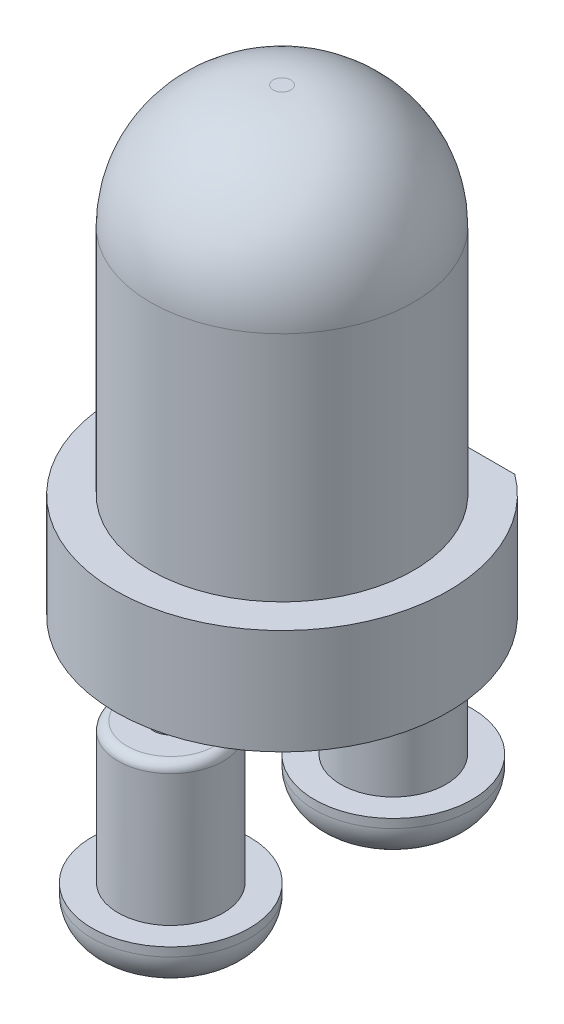
ISO-10303-21;
HEADER;
FILE_DESCRIPTION(('STEP AP214'),'2;1');
FILE_NAME('part.step','',(''),(''),'','','');
FILE_SCHEMA(('AUTOMOTIVE_DESIGN { 1 0 10303 214 1 1 1 1 }'));
ENDSEC;
DATA;
#1=APPLICATION_CONTEXT('core data for automotive mechanical design processes');
#2=APPLICATION_PROTOCOL_DEFINITION('international standard','automotive_design',2000,#1);
#3=PRODUCT_CONTEXT('',#1,'mechanical');
#4=PRODUCT('Part','Part','',(#3));
#5=PRODUCT_RELATED_PRODUCT_CATEGORY('part','',(#4));
#6=PRODUCT_DEFINITION_FORMATION('','',#4);
#7=PRODUCT_DEFINITION_CONTEXT('part definition',#1,'design');
#8=PRODUCT_DEFINITION('design','',#6,#7);
#9=PRODUCT_DEFINITION_SHAPE('','',#8);
#10=(LENGTH_UNIT() NAMED_UNIT(*) SI_UNIT(.MILLI.,.METRE.));
#11=(NAMED_UNIT(*) PLANE_ANGLE_UNIT() SI_UNIT($,.RADIAN.));
#12=(NAMED_UNIT(*) SI_UNIT($,.STERADIAN.) SOLID_ANGLE_UNIT());
#13=UNCERTAINTY_MEASURE_WITH_UNIT(LENGTH_MEASURE(1.E-05),#10,'distance_accuracy_value','');
#14=(GEOMETRIC_REPRESENTATION_CONTEXT(3) GLOBAL_UNCERTAINTY_ASSIGNED_CONTEXT((#13)) GLOBAL_UNIT_ASSIGNED_CONTEXT((#10,
#11,#12)) REPRESENTATION_CONTEXT('',''));
#15=CARTESIAN_POINT('',(0.,0.,0.));
#16=DIRECTION('',(0.,0.,1.));
#17=DIRECTION('',(1.,0.,0.));
#18=AXIS2_PLACEMENT_3D('',#15,#16,#17);
#19=CARTESIAN_POINT('',(0.,0.,0.));
#20=DIRECTION('',(0.,-1.,0.));
#21=DIRECTION('',(0.,0.,-1.));
#22=AXIS2_PLACEMENT_3D('',#19,#20,#21);
#23=PLANE('',#22);
#24=CARTESIAN_POINT('',(0.,0.,-1.27));
#25=DIRECTION('',(0.,-1.,0.));
#26=DIRECTION('',(0.,0.,-1.));
#27=AXIS2_PLACEMENT_3D('',#24,#25,#26);
#28=CIRCLE('',#27,0.2);
#29=CARTESIAN_POINT('',(0.,0.,-1.47));
#30=VERTEX_POINT('',#29);
#31=EDGE_CURVE('E175',#30,#30,#28,.T.);
#32=ORIENTED_EDGE('',*,*,#31,.F.);
#33=EDGE_LOOP('',(#32));
#34=FACE_BOUND('',#33,.T.);
#35=CARTESIAN_POINT('',(0.,0.,1.27));
#36=DIRECTION('',(0.,-1.,0.));
#37=DIRECTION('',(0.,0.,-1.));
#38=AXIS2_PLACEMENT_3D('',#35,#36,#37);
#39=CIRCLE('',#38,0.2);
#40=CARTESIAN_POINT('',(0.,0.,1.07));
#41=VERTEX_POINT('',#40);
#42=EDGE_CURVE('E178',#41,#41,#39,.T.);
#43=ORIENTED_EDGE('',*,*,#42,.F.);
#44=EDGE_LOOP('',(#43));
#45=FACE_BOUND('',#44,.T.);
#46=DIRECTION('',(1.,0.,0.));
#47=VECTOR('',#46,1.);
#48=CARTESIAN_POINT('',(-1.5,0.,-1.53));
#49=LINE('',#48,#47);
#50=CARTESIAN_POINT('',(-1.12654338576018,0.,-1.53));
#51=VERTEX_POINT('',#50);
#52=CARTESIAN_POINT('',(1.12654338576017,0.,-1.53));
#53=VERTEX_POINT('',#52);
#54=EDGE_CURVE('E60',#51,#53,#49,.T.);
#55=ORIENTED_EDGE('',*,*,#54,.T.);
#56=CARTESIAN_POINT('',(0.,0.,0.));
#57=DIRECTION('',(0.,-1.,0.));
#58=DIRECTION('',(0.,0.,-1.));
#59=AXIS2_PLACEMENT_3D('',#56,#57,#58);
#60=CIRCLE('',#59,1.9);
#61=EDGE_CURVE('E66',#53,#51,#60,.T.);
#62=ORIENTED_EDGE('',*,*,#61,.T.);
#63=EDGE_LOOP('',(#55,#62));
#64=FACE_BOUND('',#63,.T.);
#65=ADVANCED_FACE('F35',(#34,#45,#64),#23,.T.);
#66=CARTESIAN_POINT('',(0.1,5.25,0.));
#67=DIRECTION('',(0.,1.,0.));
#68=DIRECTION('',(0.,0.,1.));
#69=AXIS2_PLACEMENT_3D('',#66,#67,#68);
#70=PLANE('',#69);
#71=CARTESIAN_POINT('',(0.,5.25,0.));
#72=DIRECTION('',(0.,-1.,0.));
#73=DIRECTION('',(0.,0.,-1.));
#74=AXIS2_PLACEMENT_3D('',#71,#72,#73);
#75=CIRCLE('',#74,0.1);
#76=CARTESIAN_POINT('',(0.,5.25,-0.1));
#77=VERTEX_POINT('',#76);
#78=EDGE_CURVE('E85',#77,#77,#75,.T.);
#79=ORIENTED_EDGE('',*,*,#78,.F.);
#80=EDGE_LOOP('',(#79));
#81=FACE_BOUND('',#80,.T.);
#82=ADVANCED_FACE('F134',(#81),#70,.T.);
#83=CARTESIAN_POINT('',(0.,3.85,0.));
#84=DIRECTION('',(0.,-1.,0.));
#85=DIRECTION('',(0.,0.,-1.));
#86=AXIS2_PLACEMENT_3D('',#83,#84,#85);
#87=DEGENERATE_TOROIDAL_SURFACE('',#86,0.1,1.4,.T.);
#88=ORIENTED_EDGE('',*,*,#78,.T.);
#89=EDGE_LOOP('',(#88));
#90=FACE_BOUND('',#89,.T.);
#91=CARTESIAN_POINT('',(0.,3.85,0.));
#92=DIRECTION('',(0.,-1.,0.));
#93=DIRECTION('',(0.,0.,-1.));
#94=AXIS2_PLACEMENT_3D('',#91,#92,#93);
#95=CIRCLE('',#94,1.5);
#96=CARTESIAN_POINT('',(0.,3.85,-1.5));
#97=VERTEX_POINT('',#96);
#98=EDGE_CURVE('E82',#97,#97,#95,.T.);
#99=ORIENTED_EDGE('',*,*,#98,.F.);
#100=EDGE_LOOP('',(#99));
#101=FACE_BOUND('',#100,.T.);
#102=ADVANCED_FACE('F140',(#90,#101),#87,.T.);
#103=CARTESIAN_POINT('',(0.,0.,0.));
#104=DIRECTION('',(0.,-1.,0.));
#105=DIRECTION('',(0.,0.,-1.));
#106=AXIS2_PLACEMENT_3D('',#103,#104,#105);
#107=CYLINDRICAL_SURFACE('',#106,1.5);
#108=ORIENTED_EDGE('',*,*,#98,.T.);
#109=EDGE_LOOP('',(#108));
#110=FACE_BOUND('',#109,.T.);
#111=CARTESIAN_POINT('',(0.,1.2,0.));
#112=DIRECTION('',(0.,-1.,0.));
#113=DIRECTION('',(0.,0.,-1.));
#114=AXIS2_PLACEMENT_3D('',#111,#112,#113);
#115=CIRCLE('',#114,1.5);
#116=CARTESIAN_POINT('',(0.,1.2,-1.5));
#117=VERTEX_POINT('',#116);
#118=EDGE_CURVE('E76',#117,#117,#115,.T.);
#119=ORIENTED_EDGE('',*,*,#118,.F.);
#120=EDGE_LOOP('',(#119));
#121=FACE_BOUND('',#120,.T.);
#122=ADVANCED_FACE('F205',(#110,#121),#107,.T.);
#123=CARTESIAN_POINT('',(1.9,1.2,0.));
#124=DIRECTION('',(0.,1.,0.));
#125=DIRECTION('',(0.,0.,1.));
#126=AXIS2_PLACEMENT_3D('',#123,#124,#125);
#127=PLANE('',#126);
#128=DIRECTION('',(1.,0.,0.));
#129=VECTOR('',#128,1.);
#130=CARTESIAN_POINT('',(-1.5,1.2,-1.53));
#131=LINE('',#130,#129);
#132=CARTESIAN_POINT('',(-1.12654338576018,1.2,-1.53));
#133=VERTEX_POINT('',#132);
#134=CARTESIAN_POINT('',(1.12654338576018,1.2,-1.53));
#135=VERTEX_POINT('',#134);
#136=EDGE_CURVE('E50',#133,#135,#131,.T.);
#137=ORIENTED_EDGE('',*,*,#136,.F.);
#138=CARTESIAN_POINT('',(0.,1.2,0.));
#139=DIRECTION('',(0.,-1.,0.));
#140=DIRECTION('',(0.,0.,-1.));
#141=AXIS2_PLACEMENT_3D('',#138,#139,#140);
#142=CIRCLE('',#141,1.9);
#143=EDGE_CURVE('E72',#135,#133,#142,.T.);
#144=ORIENTED_EDGE('',*,*,#143,.F.);
#145=EDGE_LOOP('',(#137,#144));
#146=FACE_BOUND('',#145,.T.);
#147=ORIENTED_EDGE('',*,*,#118,.T.);
#148=EDGE_LOOP('',(#147));
#149=FACE_BOUND('',#148,.T.);
#150=ADVANCED_FACE('F202',(#146,#149),#127,.T.);
#151=CARTESIAN_POINT('',(0.,0.,0.));
#152=DIRECTION('',(0.,-1.,0.));
#153=DIRECTION('',(0.,0.,-1.));
#154=AXIS2_PLACEMENT_3D('',#151,#152,#153);
#155=CYLINDRICAL_SURFACE('',#154,1.9);
#156=DIRECTION('',(0.,-1.,0.));
#157=VECTOR('',#156,1.);
#158=CARTESIAN_POINT('',(-1.12654338576018,0.,-1.53));
#159=LINE('',#158,#157);
#160=EDGE_CURVE('E55',#51,#133,#159,.F.);
#161=ORIENTED_EDGE('',*,*,#160,.F.);
#162=ORIENTED_EDGE('',*,*,#61,.F.);
#163=DIRECTION('',(0.,-1.,0.));
#164=VECTOR('',#163,1.);
#165=CARTESIAN_POINT('',(1.12654338576018,0.,-1.53));
#166=LINE('',#165,#164);
#167=EDGE_CURVE('E62',#135,#53,#166,.T.);
#168=ORIENTED_EDGE('',*,*,#167,.F.);
#169=ORIENTED_EDGE('',*,*,#143,.T.);
#170=EDGE_LOOP('',(#161,#162,#168,#169));
#171=FACE_BOUND('',#170,.T.);
#172=ADVANCED_FACE('F70',(#171),#155,.T.);
#173=CARTESIAN_POINT('',(-1.5,-3.04138126514911,-1.53));
#174=DIRECTION('',(0.,0.,1.));
#175=DIRECTION('',(1.,0.,0.));
#176=AXIS2_PLACEMENT_3D('',#173,#174,#175);
#177=PLANE('',#176);
#178=ORIENTED_EDGE('',*,*,#160,.T.);
#179=ORIENTED_EDGE('',*,*,#136,.T.);
#180=ORIENTED_EDGE('',*,*,#167,.T.);
#181=ORIENTED_EDGE('',*,*,#54,.F.);
#182=EDGE_LOOP('',(#178,#179,#180,#181));
#183=FACE_BOUND('',#182,.T.);
#184=ADVANCED_FACE('F61',(#183),#177,.F.);
#185=CARTESIAN_POINT('',(0.,-17.5,1.27));
#186=DIRECTION('',(0.,1.,0.));
#187=DIRECTION('',(0.,0.,1.));
#188=AXIS2_PLACEMENT_3D('',#185,#186,#187);
#189=CYLINDRICAL_SURFACE('',#188,0.2);
#190=CARTESIAN_POINT('',(0.,-0.400000000000001,1.27));
#191=DIRECTION('',(0.,1.,0.));
#192=DIRECTION('',(0.,0.,1.));
#193=AXIS2_PLACEMENT_3D('',#190,#191,#192);
#194=CIRCLE('',#193,0.2);
#195=CARTESIAN_POINT('',(0.,-0.400000000000001,1.47));
#196=VERTEX_POINT('',#195);
#197=EDGE_CURVE('E104',#196,#196,#194,.T.);
#198=ORIENTED_EDGE('',*,*,#197,.T.);
#199=EDGE_LOOP('',(#198));
#200=FACE_BOUND('',#199,.T.);
#201=ORIENTED_EDGE('',*,*,#42,.T.);
#202=EDGE_LOOP('',(#201));
#203=FACE_BOUND('',#202,.T.);
#204=ADVANCED_FACE('F186',(#200,#203),#189,.T.);
#205=CARTESIAN_POINT('',(0.,-17.5,-1.27));
#206=DIRECTION('',(0.,1.,0.));
#207=DIRECTION('',(0.,0.,1.));
#208=AXIS2_PLACEMENT_3D('',#205,#206,#207);
#209=CYLINDRICAL_SURFACE('',#208,0.2);
#210=CARTESIAN_POINT('',(0.,-0.400000000000001,-1.27));
#211=DIRECTION('',(0.,1.,0.));
#212=DIRECTION('',(0.,0.,1.));
#213=AXIS2_PLACEMENT_3D('',#210,#211,#212);
#214=CIRCLE('',#213,0.2);
#215=CARTESIAN_POINT('',(0.,-0.400000000000001,-1.07));
#216=VERTEX_POINT('',#215);
#217=EDGE_CURVE('E108',#216,#216,#214,.T.);
#218=ORIENTED_EDGE('',*,*,#217,.T.);
#219=EDGE_LOOP('',(#218));
#220=FACE_BOUND('',#219,.T.);
#221=ORIENTED_EDGE('',*,*,#31,.T.);
#222=EDGE_LOOP('',(#221));
#223=FACE_BOUND('',#222,.T.);
#224=ADVANCED_FACE('F188',(#220,#223),#209,.T.);
#225=CARTESIAN_POINT('',(0.,-0.4,1.27));
#226=DIRECTION('',(0.,-1.,0.));
#227=DIRECTION('',(0.,0.,-1.));
#228=AXIS2_PLACEMENT_3D('',#225,#226,#227);
#229=CYLINDRICAL_SURFACE('',#228,0.6);
#230=CARTESIAN_POINT('',(0.,-0.5,1.27));
#231=DIRECTION('',(0.,1.,0.));
#232=DIRECTION('',(0.,0.,1.));
#233=AXIS2_PLACEMENT_3D('',#230,#231,#232);
#234=CIRCLE('',#233,0.6);
#235=CARTESIAN_POINT('',(0.,-0.5,1.87));
#236=VERTEX_POINT('',#235);
#237=EDGE_CURVE('E11',#236,#236,#234,.F.);
#238=ORIENTED_EDGE('',*,*,#237,.T.);
#239=EDGE_LOOP('',(#238));
#240=FACE_BOUND('',#239,.T.);
#241=CARTESIAN_POINT('',(0.,-2.,1.27));
#242=DIRECTION('',(0.,-1.,0.));
#243=DIRECTION('',(0.,0.,-1.));
#244=AXIS2_PLACEMENT_3D('',#241,#242,#243);
#245=CIRCLE('',#244,0.6);
#246=CARTESIAN_POINT('',(0.,-2.,0.67));
#247=VERTEX_POINT('',#246);
#248=EDGE_CURVE('E100',#247,#247,#245,.F.);
#249=ORIENTED_EDGE('',*,*,#248,.T.);
#250=EDGE_LOOP('',(#249));
#251=FACE_BOUND('',#250,.T.);
#252=ADVANCED_FACE('F195',(#240,#251),#229,.T.);
#253=CARTESIAN_POINT('',(0.,-0.4,1.27));
#254=DIRECTION('',(0.,1.,0.));
#255=DIRECTION('',(0.,0.,1.));
#256=AXIS2_PLACEMENT_3D('',#253,#254,#255);
#257=PLANE('',#256);
#258=CARTESIAN_POINT('',(0.,-0.4,1.27));
#259=DIRECTION('',(0.,1.,0.));
#260=DIRECTION('',(0.,0.,1.));
#261=AXIS2_PLACEMENT_3D('',#258,#259,#260);
#262=CIRCLE('',#261,0.5);
#263=CARTESIAN_POINT('',(0.,-0.4,1.77));
#264=VERTEX_POINT('',#263);
#265=EDGE_CURVE('E43',#264,#264,#262,.T.);
#266=ORIENTED_EDGE('',*,*,#265,.T.);
#267=EDGE_LOOP('',(#266));
#268=FACE_BOUND('',#267,.T.);
#269=ORIENTED_EDGE('',*,*,#197,.F.);
#270=EDGE_LOOP('',(#269));
#271=FACE_BOUND('',#270,.T.);
#272=ADVANCED_FACE('F121',(#268,#271),#257,.T.);
#273=CARTESIAN_POINT('',(0.,-2.5,1.27));
#274=DIRECTION('',(0.,-1.,0.));
#275=DIRECTION('',(0.,0.,-1.));
#276=AXIS2_PLACEMENT_3D('',#273,#274,#275);
#277=PLANE('',#276);
#278=CARTESIAN_POINT('',(0.,-2.5,1.27));
#279=DIRECTION('',(0.,-1.,0.));
#280=DIRECTION('',(0.,0.,-1.));
#281=AXIS2_PLACEMENT_3D('',#278,#279,#280);
#282=CIRCLE('',#281,0.5);
#283=CARTESIAN_POINT('',(0.,-2.5,0.77));
#284=VERTEX_POINT('',#283);
#285=EDGE_CURVE('E94',#284,#284,#282,.T.);
#286=ORIENTED_EDGE('',*,*,#285,.T.);
#287=EDGE_LOOP('',(#286));
#288=FACE_BOUND('',#287,.T.);
#289=ADVANCED_FACE('F156',(#288),#277,.T.);
#290=CARTESIAN_POINT('',(0.,-2.1,1.27));
#291=DIRECTION('',(0.,-1.,0.));
#292=DIRECTION('',(0.,0.,-1.));
#293=AXIS2_PLACEMENT_3D('',#290,#291,#292);
#294=TOROIDAL_SURFACE('',#293,0.5,0.4);
#295=CARTESIAN_POINT('',(0.,-2.1,1.27));
#296=DIRECTION('',(0.,-1.,0.));
#297=DIRECTION('',(0.,0.,-1.));
#298=AXIS2_PLACEMENT_3D('',#295,#296,#297);
#299=CIRCLE('',#298,0.9);
#300=CARTESIAN_POINT('',(0.,-2.1,0.37));
#301=VERTEX_POINT('',#300);
#302=EDGE_CURVE('E97',#301,#301,#299,.F.);
#303=ORIENTED_EDGE('',*,*,#302,.F.);
#304=EDGE_LOOP('',(#303));
#305=FACE_BOUND('',#304,.T.);
#306=ORIENTED_EDGE('',*,*,#285,.F.);
#307=EDGE_LOOP('',(#306));
#308=FACE_BOUND('',#307,.T.);
#309=ADVANCED_FACE('F153',(#305,#308),#294,.T.);
#310=CARTESIAN_POINT('',(0.,-2.5,1.27));
#311=DIRECTION('',(0.,1.,0.));
#312=DIRECTION('',(0.,0.,1.));
#313=AXIS2_PLACEMENT_3D('',#310,#311,#312);
#314=CYLINDRICAL_SURFACE('',#313,0.9);
#315=ORIENTED_EDGE('',*,*,#302,.T.);
#316=EDGE_LOOP('',(#315));
#317=FACE_BOUND('',#316,.T.);
#318=CARTESIAN_POINT('',(0.,-2.,1.27));
#319=DIRECTION('',(0.,-1.,0.));
#320=DIRECTION('',(0.,0.,-1.));
#321=AXIS2_PLACEMENT_3D('',#318,#319,#320);
#322=CIRCLE('',#321,0.9);
#323=CARTESIAN_POINT('',(0.,-2.,0.37));
#324=VERTEX_POINT('',#323);
#325=EDGE_CURVE('E173',#324,#324,#322,.T.);
#326=ORIENTED_EDGE('',*,*,#325,.T.);
#327=EDGE_LOOP('',(#326));
#328=FACE_BOUND('',#327,.T.);
#329=ADVANCED_FACE('F155',(#317,#328),#314,.T.);
#330=CARTESIAN_POINT('',(0.,-2.,1.27));
#331=DIRECTION('',(0.,-1.,0.));
#332=DIRECTION('',(0.,0.,-1.));
#333=AXIS2_PLACEMENT_3D('',#330,#331,#332);
#334=PLANE('',#333);
#335=ORIENTED_EDGE('',*,*,#248,.F.);
#336=EDGE_LOOP('',(#335));
#337=FACE_BOUND('',#336,.T.);
#338=ORIENTED_EDGE('',*,*,#325,.F.);
#339=EDGE_LOOP('',(#338));
#340=FACE_BOUND('',#339,.T.);
#341=ADVANCED_FACE('F162',(#337,#340),#334,.F.);
#342=CARTESIAN_POINT('',(0.,-0.4,-1.27));
#343=DIRECTION('',(0.,-1.,0.));
#344=DIRECTION('',(0.,0.,-1.));
#345=AXIS2_PLACEMENT_3D('',#342,#343,#344);
#346=CYLINDRICAL_SURFACE('',#345,0.6);
#347=CARTESIAN_POINT('',(0.,-0.5,-1.27));
#348=DIRECTION('',(0.,1.,0.));
#349=DIRECTION('',(0.,0.,1.));
#350=AXIS2_PLACEMENT_3D('',#347,#348,#349);
#351=CIRCLE('',#350,0.6);
#352=CARTESIAN_POINT('',(0.,-0.5,-0.67));
#353=VERTEX_POINT('',#352);
#354=EDGE_CURVE('E116',#353,#353,#351,.F.);
#355=ORIENTED_EDGE('',*,*,#354,.T.);
#356=EDGE_LOOP('',(#355));
#357=FACE_BOUND('',#356,.T.);
#358=CARTESIAN_POINT('',(0.,-2.,-1.27));
#359=DIRECTION('',(0.,-1.,0.));
#360=DIRECTION('',(0.,0.,-1.));
#361=AXIS2_PLACEMENT_3D('',#358,#359,#360);
#362=CIRCLE('',#361,0.6);
#363=CARTESIAN_POINT('',(0.,-2.,-1.87));
#364=VERTEX_POINT('',#363);
#365=EDGE_CURVE('E103',#364,#364,#362,.F.);
#366=ORIENTED_EDGE('',*,*,#365,.T.);
#367=EDGE_LOOP('',(#366));
#368=FACE_BOUND('',#367,.T.);
#369=ADVANCED_FACE('F309',(#357,#368),#346,.T.);
#370=CARTESIAN_POINT('',(0.,-0.4,-1.27));
#371=DIRECTION('',(0.,1.,0.));
#372=DIRECTION('',(0.,0.,1.));
#373=AXIS2_PLACEMENT_3D('',#370,#371,#372);
#374=PLANE('',#373);
#375=CARTESIAN_POINT('',(0.,-0.4,-1.27));
#376=DIRECTION('',(0.,1.,0.));
#377=DIRECTION('',(0.,0.,1.));
#378=AXIS2_PLACEMENT_3D('',#375,#376,#377);
#379=CIRCLE('',#378,0.5);
#380=CARTESIAN_POINT('',(0.,-0.4,-0.77));
#381=VERTEX_POINT('',#380);
#382=EDGE_CURVE('E111',#381,#381,#379,.T.);
#383=ORIENTED_EDGE('',*,*,#382,.T.);
#384=EDGE_LOOP('',(#383));
#385=FACE_BOUND('',#384,.T.);
#386=ORIENTED_EDGE('',*,*,#217,.F.);
#387=EDGE_LOOP('',(#386));
#388=FACE_BOUND('',#387,.T.);
#389=ADVANCED_FACE('F278',(#385,#388),#374,.T.);
#390=CARTESIAN_POINT('',(0.,-2.5,-1.27));
#391=DIRECTION('',(0.,-1.,0.));
#392=DIRECTION('',(0.,0.,-1.));
#393=AXIS2_PLACEMENT_3D('',#390,#391,#392);
#394=PLANE('',#393);
#395=CARTESIAN_POINT('',(0.,-2.5,-1.27));
#396=DIRECTION('',(0.,-1.,0.));
#397=DIRECTION('',(0.,0.,-1.));
#398=AXIS2_PLACEMENT_3D('',#395,#396,#397);
#399=CIRCLE('',#398,0.5);
#400=CARTESIAN_POINT('',(0.,-2.5,-1.77));
#401=VERTEX_POINT('',#400);
#402=EDGE_CURVE('E73',#401,#401,#399,.T.);
#403=ORIENTED_EDGE('',*,*,#402,.T.);
#404=EDGE_LOOP('',(#403));
#405=FACE_BOUND('',#404,.T.);
#406=ADVANCED_FACE('F151',(#405),#394,.T.);
#407=CARTESIAN_POINT('',(0.,-2.1,-1.27));
#408=DIRECTION('',(0.,-1.,0.));
#409=DIRECTION('',(0.,0.,-1.));
#410=AXIS2_PLACEMENT_3D('',#407,#408,#409);
#411=TOROIDAL_SURFACE('',#410,0.5,0.4);
#412=CARTESIAN_POINT('',(0.,-2.1,-1.27));
#413=DIRECTION('',(0.,-1.,0.));
#414=DIRECTION('',(0.,0.,-1.));
#415=AXIS2_PLACEMENT_3D('',#412,#413,#414);
#416=CIRCLE('',#415,0.9);
#417=CARTESIAN_POINT('',(0.,-2.1,-2.17));
#418=VERTEX_POINT('',#417);
#419=EDGE_CURVE('E91',#418,#418,#416,.F.);
#420=ORIENTED_EDGE('',*,*,#419,.F.);
#421=EDGE_LOOP('',(#420));
#422=FACE_BOUND('',#421,.T.);
#423=ORIENTED_EDGE('',*,*,#402,.F.);
#424=EDGE_LOOP('',(#423));
#425=FACE_BOUND('',#424,.T.);
#426=ADVANCED_FACE('F147',(#422,#425),#411,.T.);
#427=CARTESIAN_POINT('',(0.,-2.5,-1.27));
#428=DIRECTION('',(0.,1.,0.));
#429=DIRECTION('',(0.,0.,1.));
#430=AXIS2_PLACEMENT_3D('',#427,#428,#429);
#431=CYLINDRICAL_SURFACE('',#430,0.9);
#432=ORIENTED_EDGE('',*,*,#419,.T.);
#433=EDGE_LOOP('',(#432));
#434=FACE_BOUND('',#433,.T.);
#435=CARTESIAN_POINT('',(0.,-2.,-1.27));
#436=DIRECTION('',(0.,-1.,0.));
#437=DIRECTION('',(0.,0.,-1.));
#438=AXIS2_PLACEMENT_3D('',#435,#436,#437);
#439=CIRCLE('',#438,0.9);
#440=CARTESIAN_POINT('',(0.,-2.,-2.17));
#441=VERTEX_POINT('',#440);
#442=EDGE_CURVE('E107',#441,#441,#439,.T.);
#443=ORIENTED_EDGE('',*,*,#442,.T.);
#444=EDGE_LOOP('',(#443));
#445=FACE_BOUND('',#444,.T.);
#446=ADVANCED_FACE('F150',(#434,#445),#431,.T.);
#447=CARTESIAN_POINT('',(0.,-2.,-1.27));
#448=DIRECTION('',(0.,-1.,0.));
#449=DIRECTION('',(0.,0.,-1.));
#450=AXIS2_PLACEMENT_3D('',#447,#448,#449);
#451=PLANE('',#450);
#452=ORIENTED_EDGE('',*,*,#365,.F.);
#453=EDGE_LOOP('',(#452));
#454=FACE_BOUND('',#453,.T.);
#455=ORIENTED_EDGE('',*,*,#442,.F.);
#456=EDGE_LOOP('',(#455));
#457=FACE_BOUND('',#456,.T.);
#458=ADVANCED_FACE('F130',(#454,#457),#451,.F.);
#459=CARTESIAN_POINT('',(0.,-0.5,-1.27));
#460=DIRECTION('',(0.,1.,0.));
#461=DIRECTION('',(0.,0.,1.));
#462=AXIS2_PLACEMENT_3D('',#459,#460,#461);
#463=TOROIDAL_SURFACE('',#462,0.5,0.1);
#464=ORIENTED_EDGE('',*,*,#354,.F.);
#465=EDGE_LOOP('',(#464));
#466=FACE_BOUND('',#465,.T.);
#467=ORIENTED_EDGE('',*,*,#382,.F.);
#468=EDGE_LOOP('',(#467));
#469=FACE_BOUND('',#468,.T.);
#470=ADVANCED_FACE('F125',(#466,#469),#463,.T.);
#471=CARTESIAN_POINT('',(0.,-0.5,1.27));
#472=DIRECTION('',(0.,1.,0.));
#473=DIRECTION('',(0.,0.,1.));
#474=AXIS2_PLACEMENT_3D('',#471,#472,#473);
#475=TOROIDAL_SURFACE('',#474,0.5,0.1);
#476=ORIENTED_EDGE('',*,*,#237,.F.);
#477=EDGE_LOOP('',(#476));
#478=FACE_BOUND('',#477,.T.);
#479=ORIENTED_EDGE('',*,*,#265,.F.);
#480=EDGE_LOOP('',(#479));
#481=FACE_BOUND('',#480,.T.);
#482=ADVANCED_FACE('F37',(#478,#481),#475,.T.);
#483=CLOSED_SHELL('',(#65,#82,#102,#122,#150,#172,#184,#204,#224,#252,#272,#289,#309,#329,#341,
#369,#389,#406,#426,#446,#458,#470,#482));
#484=MANIFOLD_SOLID_BREP('B2',#483);
#485=ADVANCED_BREP_SHAPE_REPRESENTATION('',(#18,#484),#14);
#486=SHAPE_DEFINITION_REPRESENTATION(#9,#485);
ENDSEC;
END-ISO-10303-21;
